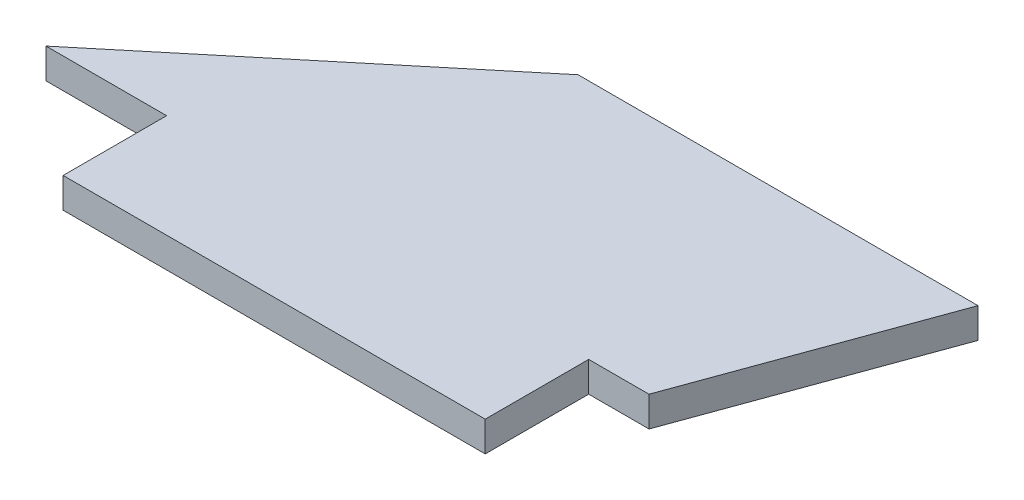
ISO-10303-21;
HEADER;
FILE_DESCRIPTION(('STEP AP214'),'2;1');
FILE_NAME('part.step','',(''),(''),'','','');
FILE_SCHEMA(('AUTOMOTIVE_DESIGN { 1 0 10303 214 1 1 1 1 }'));
ENDSEC;
DATA;
#1=APPLICATION_CONTEXT('core data for automotive mechanical design processes');
#2=APPLICATION_PROTOCOL_DEFINITION('international standard','automotive_design',2000,#1);
#3=PRODUCT_CONTEXT('',#1,'mechanical');
#4=PRODUCT('Part','Part','',(#3));
#5=PRODUCT_RELATED_PRODUCT_CATEGORY('part','',(#4));
#6=PRODUCT_DEFINITION_FORMATION('','',#4);
#7=PRODUCT_DEFINITION_CONTEXT('part definition',#1,'design');
#8=PRODUCT_DEFINITION('design','',#6,#7);
#9=PRODUCT_DEFINITION_SHAPE('','',#8);
#10=(LENGTH_UNIT() NAMED_UNIT(*) SI_UNIT(.MILLI.,.METRE.));
#11=(NAMED_UNIT(*) PLANE_ANGLE_UNIT() SI_UNIT($,.RADIAN.));
#12=(NAMED_UNIT(*) SI_UNIT($,.STERADIAN.) SOLID_ANGLE_UNIT());
#13=UNCERTAINTY_MEASURE_WITH_UNIT(LENGTH_MEASURE(1.E-05),#10,'distance_accuracy_value','');
#14=(GEOMETRIC_REPRESENTATION_CONTEXT(3) GLOBAL_UNCERTAINTY_ASSIGNED_CONTEXT((#13)) GLOBAL_UNIT_ASSIGNED_CONTEXT((#10,
#11,#12)) REPRESENTATION_CONTEXT('',''));
#15=CARTESIAN_POINT('',(0.,0.,0.));
#16=DIRECTION('',(0.,0.,1.));
#17=DIRECTION('',(1.,0.,0.));
#18=AXIS2_PLACEMENT_3D('',#15,#16,#17);
#19=CARTESIAN_POINT('',(48.2388093706483,2.5,-40.));
#20=DIRECTION('',(0.638308305928573,0.,0.769780817234747));
#21=DIRECTION('',(0.769780817234747,0.,-0.638308305928573));
#22=AXIS2_PLACEMENT_3D('',#19,#20,#21);
#23=PLANE('',#22);
#24=DIRECTION('',(-0.769780817234747,0.,0.638308305928573));
#25=VECTOR('',#24,1.);
#26=CARTESIAN_POINT('',(48.2388093706483,-2.5,-40.));
#27=LINE('',#26,#25);
#28=CARTESIAN_POINT('',(48.2388093706483,-2.5,-40.));
#29=VERTEX_POINT('',#28);
#30=CARTESIAN_POINT('',(0.,-2.5,0.));
#31=VERTEX_POINT('',#30);
#32=EDGE_CURVE('E128',#29,#31,#27,.T.);
#33=ORIENTED_EDGE('',*,*,#32,.T.);
#34=DIRECTION('',(0.,-1.,0.));
#35=VECTOR('',#34,1.);
#36=CARTESIAN_POINT('',(0.,2.5,0.));
#37=LINE('',#36,#35);
#38=CARTESIAN_POINT('',(0.,2.5,0.));
#39=VERTEX_POINT('',#38);
#40=EDGE_CURVE('E11',#39,#31,#37,.T.);
#41=ORIENTED_EDGE('',*,*,#40,.F.);
#42=DIRECTION('',(-0.769780817234747,0.,0.638308305928573));
#43=VECTOR('',#42,1.);
#44=CARTESIAN_POINT('',(48.2388093706483,2.5,-40.));
#45=LINE('',#44,#43);
#46=CARTESIAN_POINT('',(48.2388093706483,2.5,-40.));
#47=VERTEX_POINT('',#46);
#48=EDGE_CURVE('E142',#47,#39,#45,.T.);
#49=ORIENTED_EDGE('',*,*,#48,.F.);
#50=DIRECTION('',(0.,-1.,0.));
#51=VECTOR('',#50,1.);
#52=CARTESIAN_POINT('',(48.2388093706483,2.5,-40.));
#53=LINE('',#52,#51);
#54=EDGE_CURVE('E124',#47,#29,#53,.T.);
#55=ORIENTED_EDGE('',*,*,#54,.T.);
#56=EDGE_LOOP('',(#33,#41,#49,#55));
#57=FACE_BOUND('',#56,.T.);
#58=ADVANCED_FACE('F32',(#57),#23,.F.);
#59=CARTESIAN_POINT('',(0.,2.5,0.));
#60=DIRECTION('',(0.,0.,-1.));
#61=DIRECTION('',(-1.,0.,0.));
#62=AXIS2_PLACEMENT_3D('',#59,#60,#61);
#63=PLANE('',#62);
#64=DIRECTION('',(1.,0.,0.));
#65=VECTOR('',#64,1.);
#66=CARTESIAN_POINT('',(0.,-2.5,0.));
#67=LINE('',#66,#65);
#68=CARTESIAN_POINT('',(20.,-2.5,0.));
#69=VERTEX_POINT('',#68);
#70=EDGE_CURVE('E131',#31,#69,#67,.T.);
#71=ORIENTED_EDGE('',*,*,#70,.T.);
#72=DIRECTION('',(0.,-1.,0.));
#73=VECTOR('',#72,1.);
#74=CARTESIAN_POINT('',(20.,2.5,0.));
#75=LINE('',#74,#73);
#76=CARTESIAN_POINT('',(20.,2.5,0.));
#77=VERTEX_POINT('',#76);
#78=EDGE_CURVE('E40',#77,#69,#75,.T.);
#79=ORIENTED_EDGE('',*,*,#78,.F.);
#80=DIRECTION('',(1.,0.,0.));
#81=VECTOR('',#80,1.);
#82=CARTESIAN_POINT('',(0.,2.5,0.));
#83=LINE('',#82,#81);
#84=EDGE_CURVE('E91',#39,#77,#83,.T.);
#85=ORIENTED_EDGE('',*,*,#84,.F.);
#86=ORIENTED_EDGE('',*,*,#40,.T.);
#87=EDGE_LOOP('',(#71,#79,#85,#86));
#88=FACE_BOUND('',#87,.T.);
#89=ADVANCED_FACE('F177',(#88),#63,.F.);
#90=CARTESIAN_POINT('',(20.,2.5,0.));
#91=DIRECTION('',(1.,0.,0.));
#92=DIRECTION('',(0.,0.,-1.));
#93=AXIS2_PLACEMENT_3D('',#90,#91,#92);
#94=PLANE('',#93);
#95=DIRECTION('',(0.,0.,1.));
#96=VECTOR('',#95,1.);
#97=CARTESIAN_POINT('',(20.,-2.5,0.));
#98=LINE('',#97,#96);
#99=CARTESIAN_POINT('',(20.,-2.5,17.16));
#100=VERTEX_POINT('',#99);
#101=EDGE_CURVE('E133',#69,#100,#98,.T.);
#102=ORIENTED_EDGE('',*,*,#101,.T.);
#103=DIRECTION('',(0.,-1.,0.));
#104=VECTOR('',#103,1.);
#105=CARTESIAN_POINT('',(20.,2.5,17.16));
#106=LINE('',#105,#104);
#107=CARTESIAN_POINT('',(20.,2.5,17.16));
#108=VERTEX_POINT('',#107);
#109=EDGE_CURVE('E149',#108,#100,#106,.T.);
#110=ORIENTED_EDGE('',*,*,#109,.F.);
#111=DIRECTION('',(0.,0.,1.));
#112=VECTOR('',#111,1.);
#113=CARTESIAN_POINT('',(20.,2.5,0.));
#114=LINE('',#113,#112);
#115=EDGE_CURVE('E157',#77,#108,#114,.T.);
#116=ORIENTED_EDGE('',*,*,#115,.F.);
#117=ORIENTED_EDGE('',*,*,#78,.T.);
#118=EDGE_LOOP('',(#102,#110,#116,#117));
#119=FACE_BOUND('',#118,.T.);
#120=ADVANCED_FACE('F155',(#119),#94,.F.);
#121=CARTESIAN_POINT('',(20.,2.5,17.16));
#122=DIRECTION('',(0.,0.,-1.));
#123=DIRECTION('',(-1.,0.,0.));
#124=AXIS2_PLACEMENT_3D('',#121,#122,#123);
#125=PLANE('',#124);
#126=DIRECTION('',(1.,0.,0.));
#127=VECTOR('',#126,1.);
#128=CARTESIAN_POINT('',(20.,-2.5,17.16));
#129=LINE('',#128,#127);
#130=CARTESIAN_POINT('',(90.,-2.5,17.16));
#131=VERTEX_POINT('',#130);
#132=EDGE_CURVE('E135',#100,#131,#129,.T.);
#133=ORIENTED_EDGE('',*,*,#132,.T.);
#134=DIRECTION('',(0.,-1.,0.));
#135=VECTOR('',#134,1.);
#136=CARTESIAN_POINT('',(90.,2.5,17.16));
#137=LINE('',#136,#135);
#138=CARTESIAN_POINT('',(90.,2.5,17.16));
#139=VERTEX_POINT('',#138);
#140=EDGE_CURVE('E146',#139,#131,#137,.T.);
#141=ORIENTED_EDGE('',*,*,#140,.F.);
#142=DIRECTION('',(1.,0.,0.));
#143=VECTOR('',#142,1.);
#144=CARTESIAN_POINT('',(20.,2.5,17.16));
#145=LINE('',#144,#143);
#146=EDGE_CURVE('E169',#108,#139,#145,.T.);
#147=ORIENTED_EDGE('',*,*,#146,.F.);
#148=ORIENTED_EDGE('',*,*,#109,.T.);
#149=EDGE_LOOP('',(#133,#141,#147,#148));
#150=FACE_BOUND('',#149,.T.);
#151=ADVANCED_FACE('F165',(#150),#125,.F.);
#152=CARTESIAN_POINT('',(90.,2.5,17.16));
#153=DIRECTION('',(-1.,0.,0.));
#154=DIRECTION('',(0.,0.,1.));
#155=AXIS2_PLACEMENT_3D('',#152,#153,#154);
#156=PLANE('',#155);
#157=DIRECTION('',(0.,0.,-1.));
#158=VECTOR('',#157,1.);
#159=CARTESIAN_POINT('',(90.,-2.5,17.16));
#160=LINE('',#159,#158);
#161=CARTESIAN_POINT('',(90.,-2.5,0.));
#162=VERTEX_POINT('',#161);
#163=EDGE_CURVE('E137',#131,#162,#160,.T.);
#164=ORIENTED_EDGE('',*,*,#163,.T.);
#165=DIRECTION('',(0.,-1.,0.));
#166=VECTOR('',#165,1.);
#167=CARTESIAN_POINT('',(90.,2.5,0.));
#168=LINE('',#167,#166);
#169=CARTESIAN_POINT('',(90.,2.5,0.));
#170=VERTEX_POINT('',#169);
#171=EDGE_CURVE('E119',#170,#162,#168,.T.);
#172=ORIENTED_EDGE('',*,*,#171,.F.);
#173=DIRECTION('',(0.,0.,-1.));
#174=VECTOR('',#173,1.);
#175=CARTESIAN_POINT('',(90.,2.5,17.16));
#176=LINE('',#175,#174);
#177=EDGE_CURVE('E110',#139,#170,#176,.T.);
#178=ORIENTED_EDGE('',*,*,#177,.F.);
#179=ORIENTED_EDGE('',*,*,#140,.T.);
#180=EDGE_LOOP('',(#164,#172,#178,#179));
#181=FACE_BOUND('',#180,.T.);
#182=ADVANCED_FACE('F168',(#181),#156,.F.);
#183=CARTESIAN_POINT('',(90.,2.5,0.));
#184=DIRECTION('',(0.,0.,-1.));
#185=DIRECTION('',(-1.,0.,0.));
#186=AXIS2_PLACEMENT_3D('',#183,#184,#185);
#187=PLANE('',#186);
#188=DIRECTION('',(1.,0.,0.));
#189=VECTOR('',#188,1.);
#190=CARTESIAN_POINT('',(90.,-2.5,0.));
#191=LINE('',#190,#189);
#192=CARTESIAN_POINT('',(100.,-2.5,0.));
#193=VERTEX_POINT('',#192);
#194=EDGE_CURVE('E118',#162,#193,#191,.T.);
#195=ORIENTED_EDGE('',*,*,#194,.T.);
#196=DIRECTION('',(0.,-1.,0.));
#197=VECTOR('',#196,1.);
#198=CARTESIAN_POINT('',(100.,2.5,0.));
#199=LINE('',#198,#197);
#200=CARTESIAN_POINT('',(100.,2.5,0.));
#201=VERTEX_POINT('',#200);
#202=EDGE_CURVE('E115',#201,#193,#199,.T.);
#203=ORIENTED_EDGE('',*,*,#202,.F.);
#204=DIRECTION('',(1.,0.,0.));
#205=VECTOR('',#204,1.);
#206=CARTESIAN_POINT('',(90.,2.5,0.));
#207=LINE('',#206,#205);
#208=EDGE_CURVE('E104',#170,#201,#207,.T.);
#209=ORIENTED_EDGE('',*,*,#208,.F.);
#210=ORIENTED_EDGE('',*,*,#171,.T.);
#211=EDGE_LOOP('',(#195,#203,#209,#210));
#212=FACE_BOUND('',#211,.T.);
#213=ADVANCED_FACE('F116',(#212),#187,.F.);
#214=CARTESIAN_POINT('',(100.,2.5,0.));
#215=DIRECTION('',(-0.939692620785907,0.,-0.342020143325673));
#216=DIRECTION('',(-0.342020143325673,0.,0.939692620785907));
#217=AXIS2_PLACEMENT_3D('',#214,#215,#216);
#218=PLANE('',#217);
#219=DIRECTION('',(0.342020143325673,0.,-0.939692620785907));
#220=VECTOR('',#219,1.);
#221=CARTESIAN_POINT('',(100.,-2.5,0.));
#222=LINE('',#221,#220);
#223=CARTESIAN_POINT('',(114.558809370648,-2.5,-40.));
#224=VERTEX_POINT('',#223);
#225=EDGE_CURVE('E77',#193,#224,#222,.T.);
#226=ORIENTED_EDGE('',*,*,#225,.T.);
#227=DIRECTION('',(0.,-1.,0.));
#228=VECTOR('',#227,1.);
#229=CARTESIAN_POINT('',(114.558809370648,2.5,-40.));
#230=LINE('',#229,#228);
#231=CARTESIAN_POINT('',(114.558809370648,2.5,-40.));
#232=VERTEX_POINT('',#231);
#233=EDGE_CURVE('E120',#232,#224,#230,.T.);
#234=ORIENTED_EDGE('',*,*,#233,.F.);
#235=DIRECTION('',(0.342020143325673,0.,-0.939692620785907));
#236=VECTOR('',#235,1.);
#237=CARTESIAN_POINT('',(100.,2.5,0.));
#238=LINE('',#237,#236);
#239=EDGE_CURVE('E108',#201,#232,#238,.T.);
#240=ORIENTED_EDGE('',*,*,#239,.F.);
#241=ORIENTED_EDGE('',*,*,#202,.T.);
#242=EDGE_LOOP('',(#226,#234,#240,#241));
#243=FACE_BOUND('',#242,.T.);
#244=ADVANCED_FACE('F122',(#243),#218,.F.);
#245=CARTESIAN_POINT('',(114.558809370648,2.5,-40.));
#246=DIRECTION('',(0.,0.,1.));
#247=DIRECTION('',(1.,0.,0.));
#248=AXIS2_PLACEMENT_3D('',#245,#246,#247);
#249=PLANE('',#248);
#250=DIRECTION('',(-1.,0.,0.));
#251=VECTOR('',#250,1.);
#252=CARTESIAN_POINT('',(114.558809370648,-2.5,-40.));
#253=LINE('',#252,#251);
#254=EDGE_CURVE('E83',#224,#29,#253,.T.);
#255=ORIENTED_EDGE('',*,*,#254,.T.);
#256=ORIENTED_EDGE('',*,*,#54,.F.);
#257=DIRECTION('',(-1.,0.,0.));
#258=VECTOR('',#257,1.);
#259=CARTESIAN_POINT('',(114.558809370648,2.5,-40.));
#260=LINE('',#259,#258);
#261=EDGE_CURVE('E48',#232,#47,#260,.T.);
#262=ORIENTED_EDGE('',*,*,#261,.F.);
#263=ORIENTED_EDGE('',*,*,#233,.T.);
#264=EDGE_LOOP('',(#255,#256,#262,#263));
#265=FACE_BOUND('',#264,.T.);
#266=ADVANCED_FACE('F193',(#265),#249,.F.);
#267=CARTESIAN_POINT('',(0.,2.5,0.));
#268=DIRECTION('',(0.,1.,0.));
#269=DIRECTION('',(0.,0.,1.));
#270=AXIS2_PLACEMENT_3D('',#267,#268,#269);
#271=PLANE('',#270);
#272=ORIENTED_EDGE('',*,*,#48,.T.);
#273=ORIENTED_EDGE('',*,*,#84,.T.);
#274=ORIENTED_EDGE('',*,*,#115,.T.);
#275=ORIENTED_EDGE('',*,*,#146,.T.);
#276=ORIENTED_EDGE('',*,*,#177,.T.);
#277=ORIENTED_EDGE('',*,*,#208,.T.);
#278=ORIENTED_EDGE('',*,*,#239,.T.);
#279=ORIENTED_EDGE('',*,*,#261,.T.);
#280=EDGE_LOOP('',(#272,#273,#274,#275,#276,#277,#278,#279));
#281=FACE_BOUND('',#280,.T.);
#282=ADVANCED_FACE('F106',(#281),#271,.T.);
#283=CARTESIAN_POINT('',(0.,-2.5,0.));
#284=DIRECTION('',(0.,1.,0.));
#285=DIRECTION('',(0.,0.,1.));
#286=AXIS2_PLACEMENT_3D('',#283,#284,#285);
#287=PLANE('',#286);
#288=ORIENTED_EDGE('',*,*,#32,.F.);
#289=ORIENTED_EDGE('',*,*,#254,.F.);
#290=ORIENTED_EDGE('',*,*,#225,.F.);
#291=ORIENTED_EDGE('',*,*,#194,.F.);
#292=ORIENTED_EDGE('',*,*,#163,.F.);
#293=ORIENTED_EDGE('',*,*,#132,.F.);
#294=ORIENTED_EDGE('',*,*,#101,.F.);
#295=ORIENTED_EDGE('',*,*,#70,.F.);
#296=EDGE_LOOP('',(#288,#289,#290,#291,#292,#293,#294,#295));
#297=FACE_BOUND('',#296,.T.);
#298=ADVANCED_FACE('F161',(#297),#287,.F.);
#299=CLOSED_SHELL('',(#58,#89,#120,#151,#182,#213,#244,#266,#282,#298));
#300=MANIFOLD_SOLID_BREP('B2',#299);
#301=ADVANCED_BREP_SHAPE_REPRESENTATION('',(#18,#300),#14);
#302=SHAPE_DEFINITION_REPRESENTATION(#9,#301);
ENDSEC;
END-ISO-10303-21;
